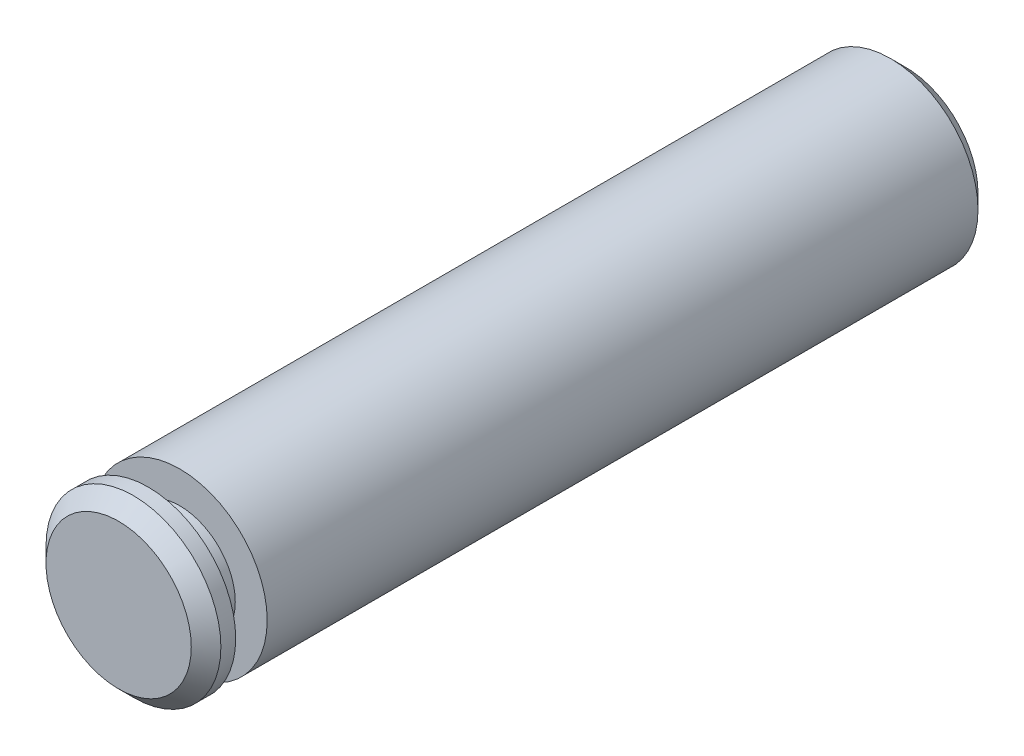
ISO-10303-21;
HEADER;
FILE_DESCRIPTION(('STEP AP214'),'2;1');
FILE_NAME('part.step','',(''),(''),'','','');
FILE_SCHEMA(('AUTOMOTIVE_DESIGN { 1 0 10303 214 1 1 1 1 }'));
ENDSEC;
DATA;
#1=APPLICATION_CONTEXT('core data for automotive mechanical design processes');
#2=APPLICATION_PROTOCOL_DEFINITION('international standard','automotive_design',2000,#1);
#3=PRODUCT_CONTEXT('',#1,'mechanical');
#4=PRODUCT('Part','Part','',(#3));
#5=PRODUCT_RELATED_PRODUCT_CATEGORY('part','',(#4));
#6=PRODUCT_DEFINITION_FORMATION('','',#4);
#7=PRODUCT_DEFINITION_CONTEXT('part definition',#1,'design');
#8=PRODUCT_DEFINITION('design','',#6,#7);
#9=PRODUCT_DEFINITION_SHAPE('','',#8);
#10=(LENGTH_UNIT() NAMED_UNIT(*) SI_UNIT(.MILLI.,.METRE.));
#11=(NAMED_UNIT(*) PLANE_ANGLE_UNIT() SI_UNIT($,.RADIAN.));
#12=(NAMED_UNIT(*) SI_UNIT($,.STERADIAN.) SOLID_ANGLE_UNIT());
#13=UNCERTAINTY_MEASURE_WITH_UNIT(LENGTH_MEASURE(1.E-05),#10,'distance_accuracy_value','');
#14=(GEOMETRIC_REPRESENTATION_CONTEXT(3) GLOBAL_UNCERTAINTY_ASSIGNED_CONTEXT((#13)) GLOBAL_UNIT_ASSIGNED_CONTEXT((#10,
#11,#12)) REPRESENTATION_CONTEXT('',''));
#15=CARTESIAN_POINT('',(0.,0.,0.));
#16=DIRECTION('',(0.,0.,1.));
#17=DIRECTION('',(1.,0.,0.));
#18=AXIS2_PLACEMENT_3D('',#15,#16,#17);
#19=CARTESIAN_POINT('',(1.94289029309402E-13,0.,6.746875));
#20=DIRECTION('',(0.,0.,-1.));
#21=DIRECTION('',(-1.,0.,0.));
#22=AXIS2_PLACEMENT_3D('',#19,#20,#21);
#23=CYLINDRICAL_SURFACE('',#22,1.49987);
#24=CARTESIAN_POINT('',(1.94289029309402E-13,0.,6.492875));
#25=DIRECTION('',(0.,0.,1.));
#26=DIRECTION('',(1.,0.,0.));
#27=AXIS2_PLACEMENT_3D('',#24,#25,#26);
#28=CIRCLE('',#27,1.49987);
#29=CARTESIAN_POINT('',(1.49987000000019,0.,6.492875));
#30=VERTEX_POINT('',#29);
#31=EDGE_CURVE('E10',#30,#30,#28,.F.);
#32=ORIENTED_EDGE('',*,*,#31,.T.);
#33=EDGE_LOOP('',(#32));
#34=FACE_BOUND('',#33,.T.);
#35=CARTESIAN_POINT('',(1.94289029309402E-13,0.,6.238875));
#36=DIRECTION('',(0.,0.,1.));
#37=DIRECTION('',(1.,0.,0.));
#38=AXIS2_PLACEMENT_3D('',#35,#36,#37);
#39=CIRCLE('',#38,1.49987);
#40=CARTESIAN_POINT('',(1.49987000000019,0.,6.238875));
#41=VERTEX_POINT('',#40);
#42=EDGE_CURVE('E70',#41,#41,#39,.T.);
#43=ORIENTED_EDGE('',*,*,#42,.T.);
#44=EDGE_LOOP('',(#43));
#45=FACE_BOUND('',#44,.T.);
#46=ADVANCED_FACE('F32',(#34,#45),#23,.T.);
#47=CARTESIAN_POINT('',(1.94289029309402E-13,0.,6.746875));
#48=DIRECTION('',(0.,0.,1.));
#49=DIRECTION('',(1.,0.,0.));
#50=AXIS2_PLACEMENT_3D('',#47,#48,#49);
#51=PLANE('',#50);
#52=CARTESIAN_POINT('',(1.94289029309402E-13,0.,6.746875));
#53=DIRECTION('',(0.,0.,1.));
#54=DIRECTION('',(1.,0.,0.));
#55=AXIS2_PLACEMENT_3D('',#52,#53,#54);
#56=CIRCLE('',#55,1.24587);
#57=CARTESIAN_POINT('',(1.24587000000019,0.,6.746875));
#58=VERTEX_POINT('',#57);
#59=EDGE_CURVE('E40',#58,#58,#56,.T.);
#60=ORIENTED_EDGE('',*,*,#59,.T.);
#61=EDGE_LOOP('',(#60));
#62=FACE_BOUND('',#61,.T.);
#63=ADVANCED_FACE('F81',(#62),#51,.T.);
#64=CARTESIAN_POINT('',(1.94289029309402E-13,-1.49987000000002,6.238875));
#65=DIRECTION('',(0.,0.,1.));
#66=DIRECTION('',(1.,0.,0.));
#67=AXIS2_PLACEMENT_3D('',#64,#65,#66);
#68=PLANE('',#67);
#69=ORIENTED_EDGE('',*,*,#42,.F.);
#70=EDGE_LOOP('',(#69));
#71=FACE_BOUND('',#70,.T.);
#72=CARTESIAN_POINT('',(1.94289029309402E-13,0.,6.238875));
#73=DIRECTION('',(0.,0.,1.));
#74=DIRECTION('',(1.,0.,0.));
#75=AXIS2_PLACEMENT_3D('',#72,#73,#74);
#76=CIRCLE('',#75,0.9525);
#77=CARTESIAN_POINT('',(0.952500000000194,0.,6.238875));
#78=VERTEX_POINT('',#77);
#79=EDGE_CURVE('E58',#78,#78,#76,.T.);
#80=ORIENTED_EDGE('',*,*,#79,.T.);
#81=EDGE_LOOP('',(#80));
#82=FACE_BOUND('',#81,.T.);
#83=ADVANCED_FACE('F77',(#71,#82),#68,.F.);
#84=CARTESIAN_POINT('',(0.,0.,8.82803245544554));
#85=DIRECTION('',(0.,0.,1.));
#86=DIRECTION('',(1.,0.,0.));
#87=AXIS2_PLACEMENT_3D('',#84,#85,#86);
#88=CYLINDRICAL_SURFACE('',#87,0.9525);
#89=ORIENTED_EDGE('',*,*,#79,.F.);
#90=EDGE_LOOP('',(#89));
#91=FACE_BOUND('',#90,.T.);
#92=CARTESIAN_POINT('',(0.,0.,5.698875));
#93=DIRECTION('',(0.,0.,1.));
#94=DIRECTION('',(1.,0.,0.));
#95=AXIS2_PLACEMENT_3D('',#92,#93,#94);
#96=CIRCLE('',#95,0.9525);
#97=CARTESIAN_POINT('',(0.9525,0.,5.698875));
#98=VERTEX_POINT('',#97);
#99=EDGE_CURVE('E62',#98,#98,#96,.T.);
#100=ORIENTED_EDGE('',*,*,#99,.T.);
#101=EDGE_LOOP('',(#100));
#102=FACE_BOUND('',#101,.T.);
#103=ADVANCED_FACE('F80',(#91,#102),#88,.T.);
#104=CARTESIAN_POINT('',(0.,-1.49987000000002,5.698875));
#105=DIRECTION('',(0.,0.,-1.));
#106=DIRECTION('',(-1.,0.,0.));
#107=AXIS2_PLACEMENT_3D('',#104,#105,#106);
#108=PLANE('',#107);
#109=ORIENTED_EDGE('',*,*,#99,.F.);
#110=EDGE_LOOP('',(#109));
#111=FACE_BOUND('',#110,.T.);
#112=CARTESIAN_POINT('',(0.,0.,5.698875));
#113=DIRECTION('',(0.,0.,1.));
#114=DIRECTION('',(1.,0.,0.));
#115=AXIS2_PLACEMENT_3D('',#112,#113,#114);
#116=CIRCLE('',#115,1.49987);
#117=CARTESIAN_POINT('',(1.49987,0.,5.698875));
#118=VERTEX_POINT('',#117);
#119=EDGE_CURVE('E66',#118,#118,#116,.T.);
#120=ORIENTED_EDGE('',*,*,#119,.T.);
#121=EDGE_LOOP('',(#120));
#122=FACE_BOUND('',#121,.T.);
#123=ADVANCED_FACE('F87',(#111,#122),#108,.F.);
#124=CARTESIAN_POINT('',(0.,0.,-6.74687499999983));
#125=DIRECTION('',(0.,0.,1.));
#126=DIRECTION('',(1.,0.,0.));
#127=AXIS2_PLACEMENT_3D('',#124,#125,#126);
#128=PLANE('',#127);
#129=CARTESIAN_POINT('',(0.,0.,-6.74687499999983));
#130=DIRECTION('',(0.,0.,1.));
#131=DIRECTION('',(1.,0.,0.));
#132=AXIS2_PLACEMENT_3D('',#129,#130,#131);
#133=CIRCLE('',#132,1.24587);
#134=CARTESIAN_POINT('',(1.24587,0.,-6.74687499999983));
#135=VERTEX_POINT('',#134);
#136=EDGE_CURVE('E46',#135,#135,#133,.F.);
#137=ORIENTED_EDGE('',*,*,#136,.T.);
#138=EDGE_LOOP('',(#137));
#139=FACE_BOUND('',#138,.T.);
#140=ADVANCED_FACE('F93',(#139),#128,.F.);
#141=CARTESIAN_POINT('',(0.,0.,-6.49287499999983));
#142=DIRECTION('',(0.,0.,1.));
#143=DIRECTION('',(1.,0.,0.));
#144=AXIS2_PLACEMENT_3D('',#141,#142,#143);
#145=CIRCLE('',#144,1.49987);
#146=CARTESIAN_POINT('',(1.49987,0.,-6.49287499999983));
#147=VERTEX_POINT('',#146);
#148=EDGE_CURVE('E52',#147,#147,#145,.T.);
#149=ORIENTED_EDGE('',*,*,#148,.T.);
#150=EDGE_LOOP('',(#149));
#151=FACE_BOUND('',#150,.T.);
#152=ORIENTED_EDGE('',*,*,#119,.F.);
#153=EDGE_LOOP('',(#152));
#154=FACE_BOUND('',#153,.T.);
#155=ADVANCED_FACE('F97',(#151,#154),#23,.T.);
#156=CARTESIAN_POINT('',(0.,0.,-6.49287499999983));
#157=DIRECTION('',(0.,0.,1.));
#158=DIRECTION('',(1.,0.,0.));
#159=AXIS2_PLACEMENT_3D('',#156,#157,#158);
#160=CONICAL_SURFACE('',#159,1.49987,0.785398163397451);
#161=ORIENTED_EDGE('',*,*,#136,.F.);
#162=EDGE_LOOP('',(#161));
#163=FACE_BOUND('',#162,.T.);
#164=ORIENTED_EDGE('',*,*,#148,.F.);
#165=EDGE_LOOP('',(#164));
#166=FACE_BOUND('',#165,.T.);
#167=ADVANCED_FACE('F99',(#163,#166),#160,.T.);
#168=CARTESIAN_POINT('',(1.94289029309402E-13,0.,6.746875));
#169=DIRECTION('',(0.,0.,-1.));
#170=DIRECTION('',(-1.,0.,0.));
#171=AXIS2_PLACEMENT_3D('',#168,#169,#170);
#172=CONICAL_SURFACE('',#171,1.24587,0.785398163397446);
#173=ORIENTED_EDGE('',*,*,#31,.F.);
#174=EDGE_LOOP('',(#173));
#175=FACE_BOUND('',#174,.T.);
#176=ORIENTED_EDGE('',*,*,#59,.F.);
#177=EDGE_LOOP('',(#176));
#178=FACE_BOUND('',#177,.T.);
#179=ADVANCED_FACE('F34',(#175,#178),#172,.T.);
#180=CLOSED_SHELL('',(#46,#63,#83,#103,#123,#140,#155,#167,#179));
#181=MANIFOLD_SOLID_BREP('B2',#180);
#182=ADVANCED_BREP_SHAPE_REPRESENTATION('',(#18,#181),#14);
#183=SHAPE_DEFINITION_REPRESENTATION(#9,#182);
ENDSEC;
END-ISO-10303-21;
